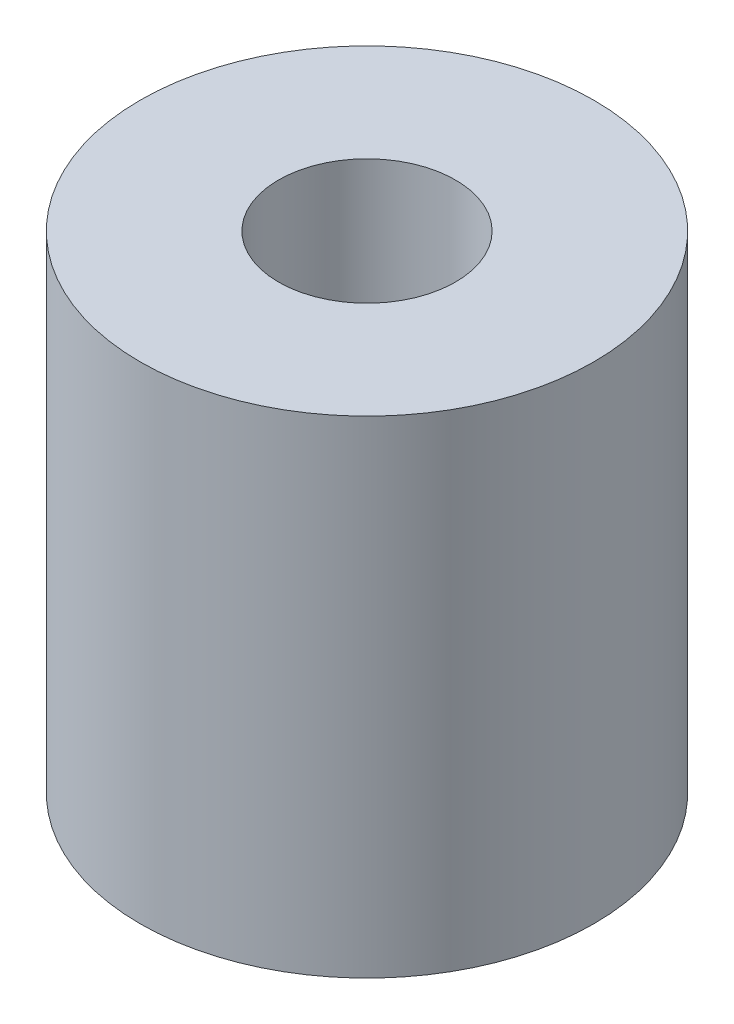
ISO-10303-21;
HEADER;
FILE_DESCRIPTION(('STEP AP214'),'2;1');
FILE_NAME('part.step','',(''),(''),'','','');
FILE_SCHEMA(('AUTOMOTIVE_DESIGN { 1 0 10303 214 1 1 1 1 }'));
ENDSEC;
DATA;
#1=APPLICATION_CONTEXT('core data for automotive mechanical design processes');
#2=APPLICATION_PROTOCOL_DEFINITION('international standard','automotive_design',2000,#1);
#3=PRODUCT_CONTEXT('',#1,'mechanical');
#4=PRODUCT('Part','Part','',(#3));
#5=PRODUCT_RELATED_PRODUCT_CATEGORY('part','',(#4));
#6=PRODUCT_DEFINITION_FORMATION('','',#4);
#7=PRODUCT_DEFINITION_CONTEXT('part definition',#1,'design');
#8=PRODUCT_DEFINITION('design','',#6,#7);
#9=PRODUCT_DEFINITION_SHAPE('','',#8);
#10=(LENGTH_UNIT() NAMED_UNIT(*) SI_UNIT(.MILLI.,.METRE.));
#11=(NAMED_UNIT(*) PLANE_ANGLE_UNIT() SI_UNIT($,.RADIAN.));
#12=(NAMED_UNIT(*) SI_UNIT($,.STERADIAN.) SOLID_ANGLE_UNIT());
#13=UNCERTAINTY_MEASURE_WITH_UNIT(LENGTH_MEASURE(1.E-05),#10,'distance_accuracy_value','');
#14=(GEOMETRIC_REPRESENTATION_CONTEXT(3) GLOBAL_UNCERTAINTY_ASSIGNED_CONTEXT((#13)) GLOBAL_UNIT_ASSIGNED_CONTEXT((#10,
#11,#12)) REPRESENTATION_CONTEXT('',''));
#15=CARTESIAN_POINT('',(0.,0.,0.));
#16=DIRECTION('',(0.,0.,1.));
#17=DIRECTION('',(1.,0.,0.));
#18=AXIS2_PLACEMENT_3D('',#15,#16,#17);
#19=CARTESIAN_POINT('',(0.,88.,0.));
#20=DIRECTION('',(0.,1.,0.));
#21=DIRECTION('',(0.,0.,1.));
#22=AXIS2_PLACEMENT_3D('',#19,#20,#21);
#23=PLANE('',#22);
#24=CARTESIAN_POINT('',(0.,88.,0.));
#25=DIRECTION('',(0.,1.,0.));
#26=DIRECTION('',(0.,0.,1.));
#27=AXIS2_PLACEMENT_3D('',#24,#25,#26);
#28=CIRCLE('',#27,41.);
#29=CARTESIAN_POINT('',(0.,88.,41.));
#30=VERTEX_POINT('',#29);
#31=EDGE_CURVE('E10',#30,#30,#28,.T.);
#32=ORIENTED_EDGE('',*,*,#31,.T.);
#33=EDGE_LOOP('',(#32));
#34=FACE_BOUND('',#33,.T.);
#35=CARTESIAN_POINT('',(0.,88.,0.));
#36=DIRECTION('',(0.,1.,0.));
#37=DIRECTION('',(0.,0.,1.));
#38=AXIS2_PLACEMENT_3D('',#35,#36,#37);
#39=CIRCLE('',#38,16.);
#40=CARTESIAN_POINT('',(0.,88.,16.));
#41=VERTEX_POINT('',#40);
#42=EDGE_CURVE('E42',#41,#41,#39,.T.);
#43=ORIENTED_EDGE('',*,*,#42,.F.);
#44=EDGE_LOOP('',(#43));
#45=FACE_BOUND('',#44,.T.);
#46=ADVANCED_FACE('F31',(#34,#45),#23,.T.);
#47=CARTESIAN_POINT('',(0.,0.,0.));
#48=DIRECTION('',(0.,1.,0.));
#49=DIRECTION('',(0.,0.,1.));
#50=AXIS2_PLACEMENT_3D('',#47,#48,#49);
#51=PLANE('',#50);
#52=CARTESIAN_POINT('',(0.,0.,0.));
#53=DIRECTION('',(0.,1.,0.));
#54=DIRECTION('',(0.,0.,1.));
#55=AXIS2_PLACEMENT_3D('',#52,#53,#54);
#56=CIRCLE('',#55,41.);
#57=CARTESIAN_POINT('',(0.,0.,41.));
#58=VERTEX_POINT('',#57);
#59=EDGE_CURVE('E35',#58,#58,#56,.T.);
#60=ORIENTED_EDGE('',*,*,#59,.F.);
#61=EDGE_LOOP('',(#60));
#62=FACE_BOUND('',#61,.T.);
#63=CARTESIAN_POINT('',(0.,0.,0.));
#64=DIRECTION('',(0.,1.,0.));
#65=DIRECTION('',(0.,0.,1.));
#66=AXIS2_PLACEMENT_3D('',#63,#64,#65);
#67=CIRCLE('',#66,16.);
#68=CARTESIAN_POINT('',(0.,0.,16.));
#69=VERTEX_POINT('',#68);
#70=EDGE_CURVE('E44',#69,#69,#67,.T.);
#71=ORIENTED_EDGE('',*,*,#70,.T.);
#72=EDGE_LOOP('',(#71));
#73=FACE_BOUND('',#72,.T.);
#74=ADVANCED_FACE('F54',(#62,#73),#51,.F.);
#75=CARTESIAN_POINT('',(0.,88.,0.));
#76=DIRECTION('',(0.,-1.,0.));
#77=DIRECTION('',(0.,0.,-1.));
#78=AXIS2_PLACEMENT_3D('',#75,#76,#77);
#79=CYLINDRICAL_SURFACE('',#78,41.);
#80=ORIENTED_EDGE('',*,*,#31,.F.);
#81=EDGE_LOOP('',(#80));
#82=FACE_BOUND('',#81,.T.);
#83=ORIENTED_EDGE('',*,*,#59,.T.);
#84=EDGE_LOOP('',(#83));
#85=FACE_BOUND('',#84,.T.);
#86=ADVANCED_FACE('F33',(#82,#85),#79,.T.);
#87=CARTESIAN_POINT('',(0.,88.,0.));
#88=DIRECTION('',(0.,-1.,0.));
#89=DIRECTION('',(0.,0.,-1.));
#90=AXIS2_PLACEMENT_3D('',#87,#88,#89);
#91=CYLINDRICAL_SURFACE('',#90,16.);
#92=ORIENTED_EDGE('',*,*,#42,.T.);
#93=EDGE_LOOP('',(#92));
#94=FACE_BOUND('',#93,.T.);
#95=ORIENTED_EDGE('',*,*,#70,.F.);
#96=EDGE_LOOP('',(#95));
#97=FACE_BOUND('',#96,.T.);
#98=ADVANCED_FACE('F50',(#94,#97),#91,.F.);
#99=CLOSED_SHELL('',(#46,#74,#86,#98));
#100=MANIFOLD_SOLID_BREP('B2',#99);
#101=ADVANCED_BREP_SHAPE_REPRESENTATION('',(#18,#100),#14);
#102=SHAPE_DEFINITION_REPRESENTATION(#9,#101);
ENDSEC;
END-ISO-10303-21;
